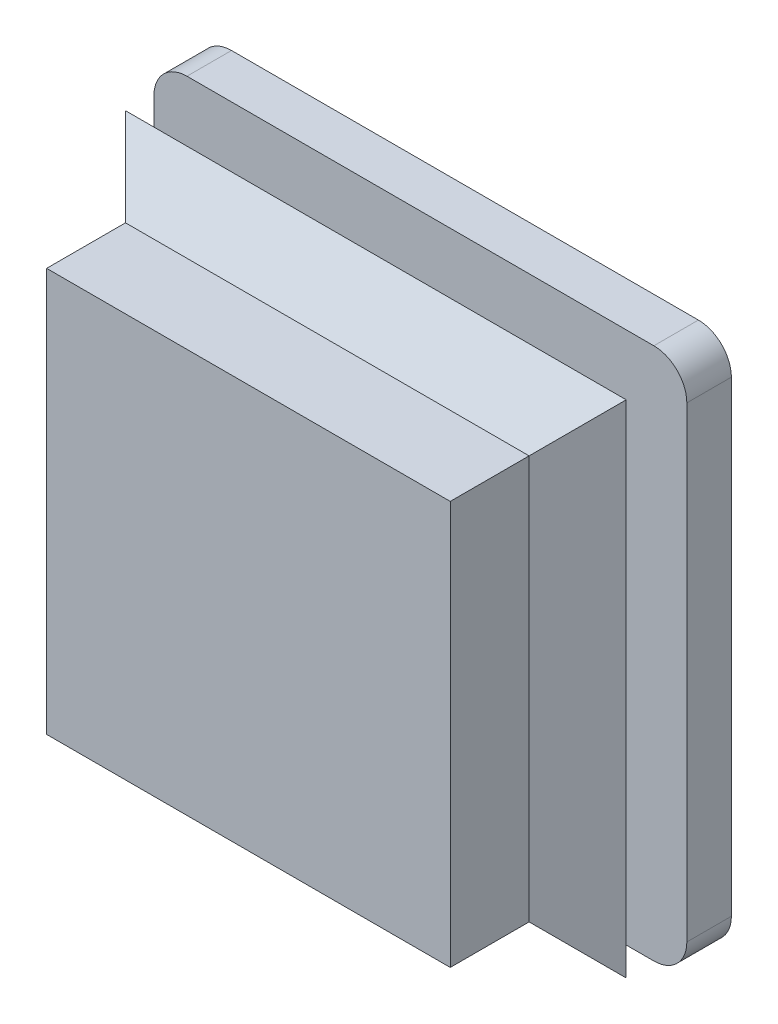
ISO-10303-21;
HEADER;
FILE_DESCRIPTION(('STEP AP214'),'2;1');
FILE_NAME('part.step','',(''),(''),'','','');
FILE_SCHEMA(('AUTOMOTIVE_DESIGN { 1 0 10303 214 1 1 1 1 }'));
ENDSEC;
DATA;
#1=APPLICATION_CONTEXT('core data for automotive mechanical design processes');
#2=APPLICATION_PROTOCOL_DEFINITION('international standard','automotive_design',2000,#1);
#3=PRODUCT_CONTEXT('',#1,'mechanical');
#4=PRODUCT('Part','Part','',(#3));
#5=PRODUCT_RELATED_PRODUCT_CATEGORY('part','',(#4));
#6=PRODUCT_DEFINITION_FORMATION('','',#4);
#7=PRODUCT_DEFINITION_CONTEXT('part definition',#1,'design');
#8=PRODUCT_DEFINITION('design','',#6,#7);
#9=PRODUCT_DEFINITION_SHAPE('','',#8);
#10=(LENGTH_UNIT() NAMED_UNIT(*) SI_UNIT(.MILLI.,.METRE.));
#11=(NAMED_UNIT(*) PLANE_ANGLE_UNIT() SI_UNIT($,.RADIAN.));
#12=(NAMED_UNIT(*) SI_UNIT($,.STERADIAN.) SOLID_ANGLE_UNIT());
#13=UNCERTAINTY_MEASURE_WITH_UNIT(LENGTH_MEASURE(1.E-05),#10,'distance_accuracy_value','');
#14=(GEOMETRIC_REPRESENTATION_CONTEXT(3) GLOBAL_UNCERTAINTY_ASSIGNED_CONTEXT((#13)) GLOBAL_UNIT_ASSIGNED_CONTEXT((#10,
#11,#12)) REPRESENTATION_CONTEXT('',''));
#15=CARTESIAN_POINT('',(0.,0.,0.));
#16=DIRECTION('',(0.,0.,1.));
#17=DIRECTION('',(1.,0.,0.));
#18=AXIS2_PLACEMENT_3D('',#15,#16,#17);
#19=CARTESIAN_POINT('',(22.65,22.65,24.3));
#20=DIRECTION('',(-1.,0.,0.));
#21=DIRECTION('',(0.,-1.,0.));
#22=AXIS2_PLACEMENT_3D('',#19,#20,#21);
#23=PLANE('',#22);
#24=DIRECTION('',(0.,1.,0.));
#25=VECTOR('',#24,1.);
#26=CARTESIAN_POINT('',(22.65,22.65,10.));
#27=LINE('',#26,#25);
#28=CARTESIAN_POINT('',(22.65,-22.65,10.));
#29=VERTEX_POINT('',#28);
#30=CARTESIAN_POINT('',(22.65,22.65,10.));
#31=VERTEX_POINT('',#30);
#32=EDGE_CURVE('E199',#29,#31,#27,.T.);
#33=ORIENTED_EDGE('',*,*,#32,.F.);
#34=DIRECTION('',(0.,0.,-1.));
#35=VECTOR('',#34,1.);
#36=CARTESIAN_POINT('',(22.65,-22.65,24.3));
#37=LINE('',#36,#35);
#38=CARTESIAN_POINT('',(22.65,-22.65,5.));
#39=VERTEX_POINT('',#38);
#40=EDGE_CURVE('E216',#29,#39,#37,.T.);
#41=ORIENTED_EDGE('',*,*,#40,.T.);
#42=DIRECTION('',(0.,-1.,0.));
#43=VECTOR('',#42,1.);
#44=CARTESIAN_POINT('',(22.65,0.,5.));
#45=LINE('',#44,#43);
#46=CARTESIAN_POINT('',(22.65,22.65,5.));
#47=VERTEX_POINT('',#46);
#48=EDGE_CURVE('E238',#47,#39,#45,.T.);
#49=ORIENTED_EDGE('',*,*,#48,.F.);
#50=DIRECTION('',(0.,0.,-1.));
#51=VECTOR('',#50,1.);
#52=CARTESIAN_POINT('',(22.65,22.65,24.3));
#53=LINE('',#52,#51);
#54=EDGE_CURVE('E226',#31,#47,#53,.T.);
#55=ORIENTED_EDGE('',*,*,#54,.F.);
#56=EDGE_LOOP('',(#33,#41,#49,#55));
#57=FACE_BOUND('',#56,.T.);
#58=ADVANCED_FACE('F33',(#57),#23,.F.);
#59=CARTESIAN_POINT('',(-22.65,22.65,24.3));
#60=DIRECTION('',(0.,-1.,0.));
#61=DIRECTION('',(0.,0.,-1.));
#62=AXIS2_PLACEMENT_3D('',#59,#60,#61);
#63=PLANE('',#62);
#64=DIRECTION('',(-1.,0.,0.));
#65=VECTOR('',#64,1.);
#66=CARTESIAN_POINT('',(-22.65,22.65,10.));
#67=LINE('',#66,#65);
#68=CARTESIAN_POINT('',(-22.65,22.65,10.));
#69=VERTEX_POINT('',#68);
#70=EDGE_CURVE('E48',#31,#69,#67,.T.);
#71=ORIENTED_EDGE('',*,*,#70,.F.);
#72=ORIENTED_EDGE('',*,*,#54,.T.);
#73=DIRECTION('',(1.,0.,0.));
#74=VECTOR('',#73,1.);
#75=CARTESIAN_POINT('',(0.,22.65,5.));
#76=LINE('',#75,#74);
#77=CARTESIAN_POINT('',(-22.65,22.65,5.));
#78=VERTEX_POINT('',#77);
#79=EDGE_CURVE('E235',#78,#47,#76,.T.);
#80=ORIENTED_EDGE('',*,*,#79,.F.);
#81=DIRECTION('',(0.,0.,-1.));
#82=VECTOR('',#81,1.);
#83=CARTESIAN_POINT('',(-22.65,22.65,24.3));
#84=LINE('',#83,#82);
#85=EDGE_CURVE('E222',#69,#78,#84,.T.);
#86=ORIENTED_EDGE('',*,*,#85,.F.);
#87=EDGE_LOOP('',(#71,#72,#80,#86));
#88=FACE_BOUND('',#87,.T.);
#89=ADVANCED_FACE('F314',(#88),#63,.F.);
#90=CARTESIAN_POINT('',(-22.65,22.65,24.3));
#91=DIRECTION('',(1.,0.,0.));
#92=DIRECTION('',(0.,1.,0.));
#93=AXIS2_PLACEMENT_3D('',#90,#91,#92);
#94=PLANE('',#93);
#95=DIRECTION('',(0.,-1.,0.));
#96=VECTOR('',#95,1.);
#97=CARTESIAN_POINT('',(-22.65,22.65,10.));
#98=LINE('',#97,#96);
#99=CARTESIAN_POINT('',(-22.65,-22.65,10.));
#100=VERTEX_POINT('',#99);
#101=EDGE_CURVE('E171',#69,#100,#98,.T.);
#102=ORIENTED_EDGE('',*,*,#101,.F.);
#103=ORIENTED_EDGE('',*,*,#85,.T.);
#104=DIRECTION('',(0.,1.,0.));
#105=VECTOR('',#104,1.);
#106=CARTESIAN_POINT('',(-22.65,0.,5.));
#107=LINE('',#106,#105);
#108=CARTESIAN_POINT('',(-22.65,-22.65,5.));
#109=VERTEX_POINT('',#108);
#110=EDGE_CURVE('E232',#109,#78,#107,.T.);
#111=ORIENTED_EDGE('',*,*,#110,.F.);
#112=DIRECTION('',(0.,0.,-1.));
#113=VECTOR('',#112,1.);
#114=CARTESIAN_POINT('',(-22.65,-22.65,24.3));
#115=LINE('',#114,#113);
#116=EDGE_CURVE('E219',#100,#109,#115,.T.);
#117=ORIENTED_EDGE('',*,*,#116,.F.);
#118=EDGE_LOOP('',(#102,#103,#111,#117));
#119=FACE_BOUND('',#118,.T.);
#120=ADVANCED_FACE('F308',(#119),#94,.F.);
#121=CARTESIAN_POINT('',(-22.65,-22.65,24.3));
#122=DIRECTION('',(0.,1.,0.));
#123=DIRECTION('',(0.,0.,1.));
#124=AXIS2_PLACEMENT_3D('',#121,#122,#123);
#125=PLANE('',#124);
#126=DIRECTION('',(1.,0.,0.));
#127=VECTOR('',#126,1.);
#128=CARTESIAN_POINT('',(-22.65,-22.65,10.));
#129=LINE('',#128,#127);
#130=EDGE_CURVE('E41',#100,#29,#129,.T.);
#131=ORIENTED_EDGE('',*,*,#130,.F.);
#132=ORIENTED_EDGE('',*,*,#116,.T.);
#133=DIRECTION('',(-1.,0.,0.));
#134=VECTOR('',#133,1.);
#135=CARTESIAN_POINT('',(0.,-22.65,5.));
#136=LINE('',#135,#134);
#137=EDGE_CURVE('E229',#39,#109,#136,.T.);
#138=ORIENTED_EDGE('',*,*,#137,.F.);
#139=ORIENTED_EDGE('',*,*,#40,.F.);
#140=EDGE_LOOP('',(#131,#132,#138,#139));
#141=FACE_BOUND('',#140,.T.);
#142=ADVANCED_FACE('F304',(#141),#125,.F.);
#143=CARTESIAN_POINT('',(0.,0.,5.));
#144=DIRECTION('',(0.,0.,1.));
#145=DIRECTION('',(1.,0.,0.));
#146=AXIS2_PLACEMENT_3D('',#143,#144,#145);
#147=PLANE('',#146);
#148=DIRECTION('',(1.,0.,0.));
#149=VECTOR('',#148,1.);
#150=CARTESIAN_POINT('',(-29.9,-29.9,5.));
#151=LINE('',#150,#149);
#152=CARTESIAN_POINT('',(-26.2,-29.9,5.));
#153=VERTEX_POINT('',#152);
#154=CARTESIAN_POINT('',(26.2,-29.9,5.));
#155=VERTEX_POINT('',#154);
#156=EDGE_CURVE('E252',#153,#155,#151,.T.);
#157=ORIENTED_EDGE('',*,*,#156,.T.);
#158=CARTESIAN_POINT('',(26.2,-26.2,5.));
#159=DIRECTION('',(0.,0.,1.));
#160=DIRECTION('',(1.,0.,0.));
#161=AXIS2_PLACEMENT_3D('',#158,#159,#160);
#162=CIRCLE('',#161,3.7);
#163=CARTESIAN_POINT('',(29.9,-26.2,5.));
#164=VERTEX_POINT('',#163);
#165=EDGE_CURVE('E289',#155,#164,#162,.T.);
#166=ORIENTED_EDGE('',*,*,#165,.T.);
#167=DIRECTION('',(0.,1.,0.));
#168=VECTOR('',#167,1.);
#169=CARTESIAN_POINT('',(29.9,29.9,5.));
#170=LINE('',#169,#168);
#171=CARTESIAN_POINT('',(29.9,26.2,5.));
#172=VERTEX_POINT('',#171);
#173=EDGE_CURVE('E242',#164,#172,#170,.T.);
#174=ORIENTED_EDGE('',*,*,#173,.T.);
#175=CARTESIAN_POINT('',(26.2,26.2,5.));
#176=DIRECTION('',(0.,0.,1.));
#177=DIRECTION('',(1.,0.,0.));
#178=AXIS2_PLACEMENT_3D('',#175,#176,#177);
#179=CIRCLE('',#178,3.7);
#180=CARTESIAN_POINT('',(26.2,29.9,5.));
#181=VERTEX_POINT('',#180);
#182=EDGE_CURVE('E283',#172,#181,#179,.T.);
#183=ORIENTED_EDGE('',*,*,#182,.T.);
#184=DIRECTION('',(-1.,0.,0.));
#185=VECTOR('',#184,1.);
#186=CARTESIAN_POINT('',(-29.9,29.9,5.));
#187=LINE('',#186,#185);
#188=CARTESIAN_POINT('',(-26.2,29.9,5.));
#189=VERTEX_POINT('',#188);
#190=EDGE_CURVE('E245',#181,#189,#187,.T.);
#191=ORIENTED_EDGE('',*,*,#190,.T.);
#192=CARTESIAN_POINT('',(-26.2,26.2,5.));
#193=DIRECTION('',(0.,0.,1.));
#194=DIRECTION('',(1.,0.,0.));
#195=AXIS2_PLACEMENT_3D('',#192,#193,#194);
#196=CIRCLE('',#195,3.7);
#197=CARTESIAN_POINT('',(-29.9,26.2,5.));
#198=VERTEX_POINT('',#197);
#199=EDGE_CURVE('E285',#189,#198,#196,.T.);
#200=ORIENTED_EDGE('',*,*,#199,.T.);
#201=DIRECTION('',(0.,-1.,0.));
#202=VECTOR('',#201,1.);
#203=CARTESIAN_POINT('',(-29.9,29.9,5.));
#204=LINE('',#203,#202);
#205=CARTESIAN_POINT('',(-29.9,-26.2,5.));
#206=VERTEX_POINT('',#205);
#207=EDGE_CURVE('E249',#198,#206,#204,.T.);
#208=ORIENTED_EDGE('',*,*,#207,.T.);
#209=CARTESIAN_POINT('',(-26.2,-26.2,5.));
#210=DIRECTION('',(0.,0.,1.));
#211=DIRECTION('',(1.,0.,0.));
#212=AXIS2_PLACEMENT_3D('',#209,#210,#211);
#213=CIRCLE('',#212,3.7);
#214=EDGE_CURVE('E287',#206,#153,#213,.T.);
#215=ORIENTED_EDGE('',*,*,#214,.T.);
#216=EDGE_LOOP('',(#157,#166,#174,#183,#191,#200,#208,#215));
#217=FACE_BOUND('',#216,.T.);
#218=ORIENTED_EDGE('',*,*,#79,.T.);
#219=ORIENTED_EDGE('',*,*,#48,.T.);
#220=ORIENTED_EDGE('',*,*,#137,.T.);
#221=ORIENTED_EDGE('',*,*,#110,.T.);
#222=EDGE_LOOP('',(#218,#219,#220,#221));
#223=FACE_BOUND('',#222,.T.);
#224=ADVANCED_FACE('F311',(#217,#223),#147,.T.);
#225=CARTESIAN_POINT('',(29.9,29.9,5.));
#226=DIRECTION('',(-1.,0.,0.));
#227=DIRECTION('',(0.,-1.,0.));
#228=AXIS2_PLACEMENT_3D('',#225,#226,#227);
#229=PLANE('',#228);
#230=ORIENTED_EDGE('',*,*,#173,.F.);
#231=DIRECTION('',(0.,0.,-1.));
#232=VECTOR('',#231,1.);
#233=CARTESIAN_POINT('',(29.9,-26.2,5.));
#234=LINE('',#233,#232);
#235=CARTESIAN_POINT('',(29.9,-26.2,0.));
#236=VERTEX_POINT('',#235);
#237=EDGE_CURVE('E267',#164,#236,#234,.T.);
#238=ORIENTED_EDGE('',*,*,#237,.T.);
#239=DIRECTION('',(0.,1.,0.));
#240=VECTOR('',#239,1.);
#241=CARTESIAN_POINT('',(29.9,29.9,0.));
#242=LINE('',#241,#240);
#243=CARTESIAN_POINT('',(29.9,26.2,0.));
#244=VERTEX_POINT('',#243);
#245=EDGE_CURVE('E241',#236,#244,#242,.T.);
#246=ORIENTED_EDGE('',*,*,#245,.T.);
#247=DIRECTION('',(0.,0.,-1.));
#248=VECTOR('',#247,1.);
#249=CARTESIAN_POINT('',(29.9,26.2,5.));
#250=LINE('',#249,#248);
#251=EDGE_CURVE('E255',#244,#172,#250,.F.);
#252=ORIENTED_EDGE('',*,*,#251,.T.);
#253=EDGE_LOOP('',(#230,#238,#246,#252));
#254=FACE_BOUND('',#253,.T.);
#255=ADVANCED_FACE('F516',(#254),#229,.F.);
#256=CARTESIAN_POINT('',(-29.9,29.9,5.));
#257=DIRECTION('',(0.,-1.,0.));
#258=DIRECTION('',(0.,0.,-1.));
#259=AXIS2_PLACEMENT_3D('',#256,#257,#258);
#260=PLANE('',#259);
#261=DIRECTION('',(-1.,0.,0.));
#262=VECTOR('',#261,1.);
#263=CARTESIAN_POINT('',(-29.9,29.9,0.));
#264=LINE('',#263,#262);
#265=CARTESIAN_POINT('',(26.2,29.9,0.));
#266=VERTEX_POINT('',#265);
#267=CARTESIAN_POINT('',(-26.2,29.9,0.));
#268=VERTEX_POINT('',#267);
#269=EDGE_CURVE('E258',#266,#268,#264,.T.);
#270=ORIENTED_EDGE('',*,*,#269,.T.);
#271=DIRECTION('',(0.,0.,-1.));
#272=VECTOR('',#271,1.);
#273=CARTESIAN_POINT('',(-26.2,29.9,5.));
#274=LINE('',#273,#272);
#275=EDGE_CURVE('E299',#268,#189,#274,.F.);
#276=ORIENTED_EDGE('',*,*,#275,.T.);
#277=ORIENTED_EDGE('',*,*,#190,.F.);
#278=DIRECTION('',(0.,0.,-1.));
#279=VECTOR('',#278,1.);
#280=CARTESIAN_POINT('',(26.2,29.9,5.));
#281=LINE('',#280,#279);
#282=EDGE_CURVE('E296',#181,#266,#281,.T.);
#283=ORIENTED_EDGE('',*,*,#282,.T.);
#284=EDGE_LOOP('',(#270,#276,#277,#283));
#285=FACE_BOUND('',#284,.T.);
#286=ADVANCED_FACE('F506',(#285),#260,.F.);
#287=CARTESIAN_POINT('',(-29.9,29.9,5.));
#288=DIRECTION('',(1.,0.,0.));
#289=DIRECTION('',(0.,1.,0.));
#290=AXIS2_PLACEMENT_3D('',#287,#288,#289);
#291=PLANE('',#290);
#292=DIRECTION('',(0.,-1.,0.));
#293=VECTOR('',#292,1.);
#294=CARTESIAN_POINT('',(-29.9,29.9,0.));
#295=LINE('',#294,#293);
#296=CARTESIAN_POINT('',(-29.9,26.2,0.));
#297=VERTEX_POINT('',#296);
#298=CARTESIAN_POINT('',(-29.9,-26.2,0.));
#299=VERTEX_POINT('',#298);
#300=EDGE_CURVE('E261',#297,#299,#295,.T.);
#301=ORIENTED_EDGE('',*,*,#300,.T.);
#302=DIRECTION('',(0.,0.,-1.));
#303=VECTOR('',#302,1.);
#304=CARTESIAN_POINT('',(-29.9,-26.2,5.));
#305=LINE('',#304,#303);
#306=EDGE_CURVE('E294',#299,#206,#305,.F.);
#307=ORIENTED_EDGE('',*,*,#306,.T.);
#308=ORIENTED_EDGE('',*,*,#207,.F.);
#309=DIRECTION('',(0.,0.,-1.));
#310=VECTOR('',#309,1.);
#311=CARTESIAN_POINT('',(-29.9,26.2,5.));
#312=LINE('',#311,#310);
#313=EDGE_CURVE('E291',#198,#297,#312,.T.);
#314=ORIENTED_EDGE('',*,*,#313,.T.);
#315=EDGE_LOOP('',(#301,#307,#308,#314));
#316=FACE_BOUND('',#315,.T.);
#317=ADVANCED_FACE('F496',(#316),#291,.F.);
#318=CARTESIAN_POINT('',(-29.9,-29.9,5.));
#319=DIRECTION('',(0.,1.,0.));
#320=DIRECTION('',(0.,0.,1.));
#321=AXIS2_PLACEMENT_3D('',#318,#319,#320);
#322=PLANE('',#321);
#323=DIRECTION('',(1.,0.,0.));
#324=VECTOR('',#323,1.);
#325=CARTESIAN_POINT('',(-29.9,-29.9,0.));
#326=LINE('',#325,#324);
#327=CARTESIAN_POINT('',(-26.2,-29.9,0.));
#328=VERTEX_POINT('',#327);
#329=CARTESIAN_POINT('',(26.2,-29.9,0.));
#330=VERTEX_POINT('',#329);
#331=EDGE_CURVE('E246',#328,#330,#326,.T.);
#332=ORIENTED_EDGE('',*,*,#331,.T.);
#333=DIRECTION('',(0.,0.,-1.));
#334=VECTOR('',#333,1.);
#335=CARTESIAN_POINT('',(26.2,-29.9,5.));
#336=LINE('',#335,#334);
#337=EDGE_CURVE('E281',#330,#155,#336,.F.);
#338=ORIENTED_EDGE('',*,*,#337,.T.);
#339=ORIENTED_EDGE('',*,*,#156,.F.);
#340=DIRECTION('',(0.,0.,-1.));
#341=VECTOR('',#340,1.);
#342=CARTESIAN_POINT('',(-26.2,-29.9,5.));
#343=LINE('',#342,#341);
#344=EDGE_CURVE('E278',#153,#328,#343,.T.);
#345=ORIENTED_EDGE('',*,*,#344,.T.);
#346=EDGE_LOOP('',(#332,#338,#339,#345));
#347=FACE_BOUND('',#346,.T.);
#348=ADVANCED_FACE('F485',(#347),#322,.F.);
#349=CARTESIAN_POINT('',(0.,0.,0.));
#350=DIRECTION('',(0.,0.,1.));
#351=DIRECTION('',(1.,0.,0.));
#352=AXIS2_PLACEMENT_3D('',#349,#350,#351);
#353=PLANE('',#352);
#354=ORIENTED_EDGE('',*,*,#245,.F.);
#355=CARTESIAN_POINT('',(26.2,-26.2,0.));
#356=DIRECTION('',(0.,0.,1.));
#357=DIRECTION('',(1.,0.,0.));
#358=AXIS2_PLACEMENT_3D('',#355,#356,#357);
#359=CIRCLE('',#358,3.7);
#360=EDGE_CURVE('E276',#236,#330,#359,.F.);
#361=ORIENTED_EDGE('',*,*,#360,.T.);
#362=ORIENTED_EDGE('',*,*,#331,.F.);
#363=CARTESIAN_POINT('',(-26.2,-26.2,0.));
#364=DIRECTION('',(0.,0.,1.));
#365=DIRECTION('',(1.,0.,0.));
#366=AXIS2_PLACEMENT_3D('',#363,#364,#365);
#367=CIRCLE('',#366,3.7);
#368=EDGE_CURVE('E274',#328,#299,#367,.F.);
#369=ORIENTED_EDGE('',*,*,#368,.T.);
#370=ORIENTED_EDGE('',*,*,#300,.F.);
#371=CARTESIAN_POINT('',(-26.2,26.2,0.));
#372=DIRECTION('',(0.,0.,1.));
#373=DIRECTION('',(1.,0.,0.));
#374=AXIS2_PLACEMENT_3D('',#371,#372,#373);
#375=CIRCLE('',#374,3.7);
#376=EDGE_CURVE('E272',#297,#268,#375,.F.);
#377=ORIENTED_EDGE('',*,*,#376,.T.);
#378=ORIENTED_EDGE('',*,*,#269,.F.);
#379=CARTESIAN_POINT('',(26.2,26.2,0.));
#380=DIRECTION('',(0.,0.,1.));
#381=DIRECTION('',(1.,0.,0.));
#382=AXIS2_PLACEMENT_3D('',#379,#380,#381);
#383=CIRCLE('',#382,3.7);
#384=EDGE_CURVE('E270',#266,#244,#383,.F.);
#385=ORIENTED_EDGE('',*,*,#384,.T.);
#386=EDGE_LOOP('',(#354,#361,#362,#369,#370,#377,#378,#385));
#387=FACE_BOUND('',#386,.T.);
#388=ADVANCED_FACE('F474',(#387),#353,.F.);
#389=CARTESIAN_POINT('',(26.2,-26.2,5.));
#390=DIRECTION('',(0.,0.,-1.));
#391=DIRECTION('',(-1.,0.,0.));
#392=AXIS2_PLACEMENT_3D('',#389,#390,#391);
#393=CYLINDRICAL_SURFACE('',#392,3.7);
#394=ORIENTED_EDGE('',*,*,#165,.F.);
#395=ORIENTED_EDGE('',*,*,#337,.F.);
#396=ORIENTED_EDGE('',*,*,#360,.F.);
#397=ORIENTED_EDGE('',*,*,#237,.F.);
#398=EDGE_LOOP('',(#394,#395,#396,#397));
#399=FACE_BOUND('',#398,.T.);
#400=ADVANCED_FACE('F464',(#399),#393,.T.);
#401=CARTESIAN_POINT('',(-26.2,-26.2,5.));
#402=DIRECTION('',(0.,0.,-1.));
#403=DIRECTION('',(-1.,0.,0.));
#404=AXIS2_PLACEMENT_3D('',#401,#402,#403);
#405=CYLINDRICAL_SURFACE('',#404,3.7);
#406=ORIENTED_EDGE('',*,*,#214,.F.);
#407=ORIENTED_EDGE('',*,*,#306,.F.);
#408=ORIENTED_EDGE('',*,*,#368,.F.);
#409=ORIENTED_EDGE('',*,*,#344,.F.);
#410=EDGE_LOOP('',(#406,#407,#408,#409));
#411=FACE_BOUND('',#410,.T.);
#412=ADVANCED_FACE('F455',(#411),#405,.T.);
#413=CARTESIAN_POINT('',(-26.2,26.2,5.));
#414=DIRECTION('',(0.,0.,-1.));
#415=DIRECTION('',(-1.,0.,0.));
#416=AXIS2_PLACEMENT_3D('',#413,#414,#415);
#417=CYLINDRICAL_SURFACE('',#416,3.7);
#418=ORIENTED_EDGE('',*,*,#199,.F.);
#419=ORIENTED_EDGE('',*,*,#275,.F.);
#420=ORIENTED_EDGE('',*,*,#376,.F.);
#421=ORIENTED_EDGE('',*,*,#313,.F.);
#422=EDGE_LOOP('',(#418,#419,#420,#421));
#423=FACE_BOUND('',#422,.T.);
#424=ADVANCED_FACE('F446',(#423),#417,.T.);
#425=CARTESIAN_POINT('',(26.2,26.2,5.));
#426=DIRECTION('',(0.,0.,-1.));
#427=DIRECTION('',(-1.,0.,0.));
#428=AXIS2_PLACEMENT_3D('',#425,#426,#427);
#429=CYLINDRICAL_SURFACE('',#428,3.7);
#430=ORIENTED_EDGE('',*,*,#182,.F.);
#431=ORIENTED_EDGE('',*,*,#251,.F.);
#432=ORIENTED_EDGE('',*,*,#384,.F.);
#433=ORIENTED_EDGE('',*,*,#282,.F.);
#434=EDGE_LOOP('',(#430,#431,#432,#433));
#435=FACE_BOUND('',#434,.T.);
#436=ADVANCED_FACE('F35',(#435),#429,.T.);
#437=CARTESIAN_POINT('',(-28.1,28.1,10.));
#438=DIRECTION('',(0.,0.707106781186546,0.707106781186549));
#439=DIRECTION('',(0.,-0.707106781186549,0.707106781186546));
#440=AXIS2_PLACEMENT_3D('',#437,#438,#439);
#441=PLANE('',#440);
#442=DIRECTION('',(-0.577350269189627,0.577350269189627,-0.577350269189624));
#443=VECTOR('',#442,1.);
#444=CARTESIAN_POINT('',(-28.1,28.1,10.));
#445=LINE('',#444,#443);
#446=CARTESIAN_POINT('',(-22.65,22.65,15.45));
#447=VERTEX_POINT('',#446);
#448=CARTESIAN_POINT('',(-28.1,28.1,10.));
#449=VERTEX_POINT('',#448);
#450=EDGE_CURVE('E172',#447,#449,#445,.T.);
#451=ORIENTED_EDGE('',*,*,#450,.F.);
#452=DIRECTION('',(-1.,0.,0.));
#453=VECTOR('',#452,1.);
#454=CARTESIAN_POINT('',(-22.65,22.65,15.45));
#455=LINE('',#454,#453);
#456=CARTESIAN_POINT('',(22.65,22.65,15.45));
#457=VERTEX_POINT('',#456);
#458=EDGE_CURVE('E168',#447,#457,#455,.F.);
#459=ORIENTED_EDGE('',*,*,#458,.T.);
#460=DIRECTION('',(0.577350269189626,0.577350269189627,-0.577350269189624));
#461=VECTOR('',#460,1.);
#462=CARTESIAN_POINT('',(9.36666666666661,9.36666666666663,28.7333333333333));
#463=LINE('',#462,#461);
#464=CARTESIAN_POINT('',(28.1,28.1,10.));
#465=VERTEX_POINT('',#464);
#466=EDGE_CURVE('E162',#457,#465,#463,.T.);
#467=ORIENTED_EDGE('',*,*,#466,.T.);
#468=DIRECTION('',(-1.,0.,0.));
#469=VECTOR('',#468,1.);
#470=CARTESIAN_POINT('',(-28.1,28.1,10.));
#471=LINE('',#470,#469);
#472=EDGE_CURVE('E166',#465,#449,#471,.T.);
#473=ORIENTED_EDGE('',*,*,#472,.T.);
#474=EDGE_LOOP('',(#451,#459,#467,#473));
#475=FACE_BOUND('',#474,.T.);
#476=ADVANCED_FACE('F165',(#475),#441,.T.);
#477=CARTESIAN_POINT('',(28.1,28.1,10.));
#478=DIRECTION('',(0.707106781186546,0.,0.707106781186549));
#479=DIRECTION('',(0.707106781186549,0.,-0.707106781186546));
#480=AXIS2_PLACEMENT_3D('',#477,#478,#479);
#481=PLANE('',#480);
#482=ORIENTED_EDGE('',*,*,#466,.F.);
#483=DIRECTION('',(0.,1.,0.));
#484=VECTOR('',#483,1.);
#485=CARTESIAN_POINT('',(22.65,22.65,15.45));
#486=LINE('',#485,#484);
#487=CARTESIAN_POINT('',(22.65,-22.65,15.45));
#488=VERTEX_POINT('',#487);
#489=EDGE_CURVE('E56',#457,#488,#486,.F.);
#490=ORIENTED_EDGE('',*,*,#489,.T.);
#491=DIRECTION('',(0.577350269189627,-0.577350269189627,-0.577350269189624));
#492=VECTOR('',#491,1.);
#493=CARTESIAN_POINT('',(9.36666666666661,-9.36666666666662,28.7333333333333));
#494=LINE('',#493,#492);
#495=CARTESIAN_POINT('',(28.1,-28.1,10.));
#496=VERTEX_POINT('',#495);
#497=EDGE_CURVE('E185',#488,#496,#494,.T.);
#498=ORIENTED_EDGE('',*,*,#497,.T.);
#499=DIRECTION('',(0.,1.,0.));
#500=VECTOR('',#499,1.);
#501=CARTESIAN_POINT('',(28.1,28.1,10.));
#502=LINE('',#501,#500);
#503=EDGE_CURVE('E179',#496,#465,#502,.T.);
#504=ORIENTED_EDGE('',*,*,#503,.T.);
#505=EDGE_LOOP('',(#482,#490,#498,#504));
#506=FACE_BOUND('',#505,.T.);
#507=ADVANCED_FACE('F183',(#506),#481,.T.);
#508=CARTESIAN_POINT('',(-28.1,28.1,10.));
#509=DIRECTION('',(-0.707106781186546,0.,0.707106781186549));
#510=DIRECTION('',(0.707106781186549,0.,0.707106781186546));
#511=AXIS2_PLACEMENT_3D('',#508,#509,#510);
#512=PLANE('',#511);
#513=DIRECTION('',(-0.577350269189626,-0.577350269189627,-0.577350269189624));
#514=VECTOR('',#513,1.);
#515=CARTESIAN_POINT('',(-28.1,-28.1,10.));
#516=LINE('',#515,#514);
#517=CARTESIAN_POINT('',(-22.65,-22.65,15.45));
#518=VERTEX_POINT('',#517);
#519=CARTESIAN_POINT('',(-28.1,-28.1,10.));
#520=VERTEX_POINT('',#519);
#521=EDGE_CURVE('E193',#518,#520,#516,.T.);
#522=ORIENTED_EDGE('',*,*,#521,.F.);
#523=DIRECTION('',(0.,-1.,0.));
#524=VECTOR('',#523,1.);
#525=CARTESIAN_POINT('',(-22.65,22.65,15.45));
#526=LINE('',#525,#524);
#527=EDGE_CURVE('E202',#518,#447,#526,.F.);
#528=ORIENTED_EDGE('',*,*,#527,.T.);
#529=ORIENTED_EDGE('',*,*,#450,.T.);
#530=DIRECTION('',(0.,-1.,0.));
#531=VECTOR('',#530,1.);
#532=CARTESIAN_POINT('',(-28.1,28.1,10.));
#533=LINE('',#532,#531);
#534=EDGE_CURVE('E181',#449,#520,#533,.T.);
#535=ORIENTED_EDGE('',*,*,#534,.T.);
#536=EDGE_LOOP('',(#522,#528,#529,#535));
#537=FACE_BOUND('',#536,.T.);
#538=ADVANCED_FACE('F340',(#537),#512,.T.);
#539=CARTESIAN_POINT('',(-28.1,-28.1,10.));
#540=DIRECTION('',(0.,-0.707106781186546,0.707106781186549));
#541=DIRECTION('',(0.,-0.707106781186549,-0.707106781186546));
#542=AXIS2_PLACEMENT_3D('',#539,#540,#541);
#543=PLANE('',#542);
#544=ORIENTED_EDGE('',*,*,#497,.F.);
#545=DIRECTION('',(1.,0.,0.));
#546=VECTOR('',#545,1.);
#547=CARTESIAN_POINT('',(-22.65,-22.65,15.45));
#548=LINE('',#547,#546);
#549=EDGE_CURVE('E11',#488,#518,#548,.F.);
#550=ORIENTED_EDGE('',*,*,#549,.T.);
#551=ORIENTED_EDGE('',*,*,#521,.T.);
#552=DIRECTION('',(1.,0.,0.));
#553=VECTOR('',#552,1.);
#554=CARTESIAN_POINT('',(-28.1,-28.1,10.));
#555=LINE('',#554,#553);
#556=EDGE_CURVE('E190',#520,#496,#555,.T.);
#557=ORIENTED_EDGE('',*,*,#556,.T.);
#558=EDGE_LOOP('',(#544,#550,#551,#557));
#559=FACE_BOUND('',#558,.T.);
#560=ADVANCED_FACE('F342',(#559),#543,.T.);
#561=CARTESIAN_POINT('',(0.,0.,10.));
#562=DIRECTION('',(0.,0.,1.));
#563=DIRECTION('',(1.,0.,0.));
#564=AXIS2_PLACEMENT_3D('',#561,#562,#563);
#565=PLANE('',#564);
#566=ORIENTED_EDGE('',*,*,#503,.F.);
#567=ORIENTED_EDGE('',*,*,#556,.F.);
#568=ORIENTED_EDGE('',*,*,#534,.F.);
#569=ORIENTED_EDGE('',*,*,#472,.F.);
#570=EDGE_LOOP('',(#566,#567,#568,#569));
#571=FACE_BOUND('',#570,.T.);
#572=ORIENTED_EDGE('',*,*,#130,.T.);
#573=ORIENTED_EDGE('',*,*,#32,.T.);
#574=ORIENTED_EDGE('',*,*,#70,.T.);
#575=ORIENTED_EDGE('',*,*,#101,.T.);
#576=EDGE_LOOP('',(#572,#573,#574,#575));
#577=FACE_BOUND('',#576,.T.);
#578=ADVANCED_FACE('F176',(#571,#577),#565,.F.);
#579=CARTESIAN_POINT('',(0.,0.,24.3));
#580=DIRECTION('',(0.,0.,1.));
#581=DIRECTION('',(1.,0.,0.));
#582=AXIS2_PLACEMENT_3D('',#579,#580,#581);
#583=PLANE('',#582);
#584=DIRECTION('',(0.,1.,0.));
#585=VECTOR('',#584,1.);
#586=CARTESIAN_POINT('',(22.65,22.65,24.3));
#587=LINE('',#586,#585);
#588=CARTESIAN_POINT('',(22.65,-22.65,24.3));
#589=VERTEX_POINT('',#588);
#590=CARTESIAN_POINT('',(22.65,22.65,24.3));
#591=VERTEX_POINT('',#590);
#592=EDGE_CURVE('E207',#589,#591,#587,.T.);
#593=ORIENTED_EDGE('',*,*,#592,.T.);
#594=DIRECTION('',(-1.,0.,0.));
#595=VECTOR('',#594,1.);
#596=CARTESIAN_POINT('',(-22.65,22.65,24.3));
#597=LINE('',#596,#595);
#598=CARTESIAN_POINT('',(-22.65,22.65,24.3));
#599=VERTEX_POINT('',#598);
#600=EDGE_CURVE('E210',#591,#599,#597,.T.);
#601=ORIENTED_EDGE('',*,*,#600,.T.);
#602=DIRECTION('',(0.,-1.,0.));
#603=VECTOR('',#602,1.);
#604=CARTESIAN_POINT('',(-22.65,22.65,24.3));
#605=LINE('',#604,#603);
#606=CARTESIAN_POINT('',(-22.65,-22.65,24.3));
#607=VERTEX_POINT('',#606);
#608=EDGE_CURVE('E212',#599,#607,#605,.T.);
#609=ORIENTED_EDGE('',*,*,#608,.T.);
#610=DIRECTION('',(1.,0.,0.));
#611=VECTOR('',#610,1.);
#612=CARTESIAN_POINT('',(-22.65,-22.65,24.3));
#613=LINE('',#612,#611);
#614=EDGE_CURVE('E214',#607,#589,#613,.T.);
#615=ORIENTED_EDGE('',*,*,#614,.T.);
#616=EDGE_LOOP('',(#593,#601,#609,#615));
#617=FACE_BOUND('',#616,.T.);
#618=ADVANCED_FACE('F348',(#617),#583,.T.);
#619=ORIENTED_EDGE('',*,*,#549,.F.);
#620=EDGE_CURVE('E217',#589,#488,#37,.T.);
#621=ORIENTED_EDGE('',*,*,#620,.F.);
#622=ORIENTED_EDGE('',*,*,#614,.F.);
#623=EDGE_CURVE('E220',#607,#518,#115,.T.);
#624=ORIENTED_EDGE('',*,*,#623,.T.);
#625=EDGE_LOOP('',(#619,#621,#622,#624));
#626=FACE_BOUND('',#625,.T.);
#627=ADVANCED_FACE('F332',(#626),#125,.F.);
#628=ORIENTED_EDGE('',*,*,#527,.F.);
#629=ORIENTED_EDGE('',*,*,#623,.F.);
#630=ORIENTED_EDGE('',*,*,#608,.F.);
#631=EDGE_CURVE('E223',#599,#447,#84,.T.);
#632=ORIENTED_EDGE('',*,*,#631,.T.);
#633=EDGE_LOOP('',(#628,#629,#630,#632));
#634=FACE_BOUND('',#633,.T.);
#635=ADVANCED_FACE('F323',(#634),#94,.F.);
#636=ORIENTED_EDGE('',*,*,#458,.F.);
#637=ORIENTED_EDGE('',*,*,#631,.F.);
#638=ORIENTED_EDGE('',*,*,#600,.F.);
#639=EDGE_CURVE('E227',#591,#457,#53,.T.);
#640=ORIENTED_EDGE('',*,*,#639,.T.);
#641=EDGE_LOOP('',(#636,#637,#638,#640));
#642=FACE_BOUND('',#641,.T.);
#643=ADVANCED_FACE('F317',(#642),#63,.F.);
#644=ORIENTED_EDGE('',*,*,#489,.F.);
#645=ORIENTED_EDGE('',*,*,#639,.F.);
#646=ORIENTED_EDGE('',*,*,#592,.F.);
#647=ORIENTED_EDGE('',*,*,#620,.T.);
#648=EDGE_LOOP('',(#644,#645,#646,#647));
#649=FACE_BOUND('',#648,.T.);
#650=ADVANCED_FACE('F325',(#649),#23,.F.);
#651=CLOSED_SHELL('',(#58,#89,#120,#142,#224,#255,#286,#317,#348,#388,#400,#412,#424,#436,#476,
#507,#538,#560,#578,#618,#627,#635,#643,#650));
#652=MANIFOLD_SOLID_BREP('B2',#651);
#653=ADVANCED_BREP_SHAPE_REPRESENTATION('',(#18,#652),#14);
#654=SHAPE_DEFINITION_REPRESENTATION(#9,#653);
ENDSEC;
END-ISO-10303-21;
